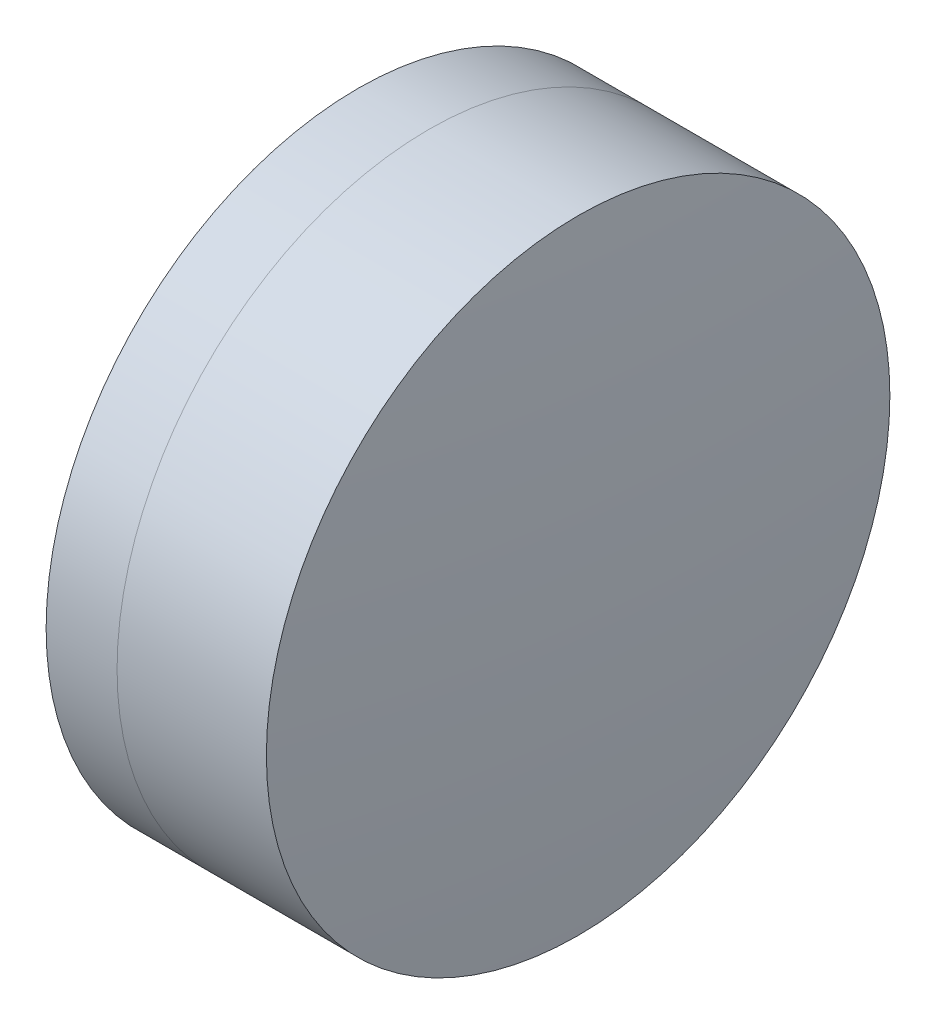
ISO-10303-21;
HEADER;
FILE_DESCRIPTION(('STEP AP214'),'2;1');
FILE_NAME('part.step','',(''),(''),'','','');
FILE_SCHEMA(('AUTOMOTIVE_DESIGN { 1 0 10303 214 1 1 1 1 }'));
ENDSEC;
DATA;
#1=APPLICATION_CONTEXT('core data for automotive mechanical design processes');
#2=APPLICATION_PROTOCOL_DEFINITION('international standard','automotive_design',2000,#1);
#3=PRODUCT_CONTEXT('',#1,'mechanical');
#4=PRODUCT('Part','Part','',(#3));
#5=PRODUCT_RELATED_PRODUCT_CATEGORY('part','',(#4));
#6=PRODUCT_DEFINITION_FORMATION('','',#4);
#7=PRODUCT_DEFINITION_CONTEXT('part definition',#1,'design');
#8=PRODUCT_DEFINITION('design','',#6,#7);
#9=PRODUCT_DEFINITION_SHAPE('','',#8);
#10=(LENGTH_UNIT() NAMED_UNIT(*) SI_UNIT(.MILLI.,.METRE.));
#11=(NAMED_UNIT(*) PLANE_ANGLE_UNIT() SI_UNIT($,.RADIAN.));
#12=(NAMED_UNIT(*) SI_UNIT($,.STERADIAN.) SOLID_ANGLE_UNIT());
#13=UNCERTAINTY_MEASURE_WITH_UNIT(LENGTH_MEASURE(1.E-05),#10,'distance_accuracy_value','');
#14=(GEOMETRIC_REPRESENTATION_CONTEXT(3) GLOBAL_UNCERTAINTY_ASSIGNED_CONTEXT((#13)) GLOBAL_UNIT_ASSIGNED_CONTEXT((#10,
#11,#12)) REPRESENTATION_CONTEXT('',''));
#15=CARTESIAN_POINT('',(0.,0.,0.));
#16=DIRECTION('',(0.,0.,1.));
#17=DIRECTION('',(1.,0.,0.));
#18=AXIS2_PLACEMENT_3D('',#15,#16,#17);
#19=CARTESIAN_POINT('',(257.503074490827,0.,0.));
#20=DIRECTION('',(-1.,0.,0.));
#21=DIRECTION('',(0.,0.,1.));
#22=AXIS2_PLACEMENT_3D('',#19,#20,#21);
#23=SPHERICAL_SURFACE('',#22,10.6);
#24=CARTESIAN_POINT('',(267.319387444274,0.,0.));
#25=DIRECTION('',(-1.,0.,0.));
#26=DIRECTION('',(0.,0.,1.));
#27=AXIS2_PLACEMENT_3D('',#24,#25,#26);
#28=CIRCLE('',#27,4.);
#29=CARTESIAN_POINT('',(267.319387444274,0.,4.));
#30=VERTEX_POINT('',#29);
#31=EDGE_CURVE('E11',#30,#30,#28,.T.);
#32=ORIENTED_EDGE('',*,*,#31,.T.);
#33=EDGE_LOOP('',(#32));
#34=FACE_BOUND('',#33,.T.);
#35=ADVANCED_FACE('F45',(#34),#23,.F.);
#36=CARTESIAN_POINT('',(-0.551919992657797,0.,0.));
#37=DIRECTION('',(-1.,0.,0.));
#38=DIRECTION('',(0.,0.,1.));
#39=AXIS2_PLACEMENT_3D('',#36,#37,#38);
#40=CYLINDRICAL_SURFACE('',#39,4.);
#41=CARTESIAN_POINT('',(269.235416444588,0.,0.));
#42=DIRECTION('',(-1.,0.,0.));
#43=DIRECTION('',(0.,0.,1.));
#44=AXIS2_PLACEMENT_3D('',#41,#42,#43);
#45=CIRCLE('',#44,4.);
#46=CARTESIAN_POINT('',(269.235416444588,0.,4.));
#47=VERTEX_POINT('',#46);
#48=EDGE_CURVE('E51',#47,#47,#45,.T.);
#49=ORIENTED_EDGE('',*,*,#48,.T.);
#50=EDGE_LOOP('',(#49));
#51=FACE_BOUND('',#50,.T.);
#52=ORIENTED_EDGE('',*,*,#31,.F.);
#53=EDGE_LOOP('',(#52));
#54=FACE_BOUND('',#53,.T.);
#55=ADVANCED_FACE('F57',(#51,#54),#40,.T.);
#56=CARTESIAN_POINT('',(221.603074490827,0.,0.));
#57=DIRECTION('',(-1.,0.,0.));
#58=DIRECTION('',(0.,0.,1.));
#59=AXIS2_PLACEMENT_3D('',#56,#57,#58);
#60=SPHERICAL_SURFACE('',#59,47.8);
#61=ORIENTED_EDGE('',*,*,#48,.F.);
#62=EDGE_LOOP('',(#61));
#63=FACE_BOUND('',#62,.T.);
#64=ADVANCED_FACE('F60',(#63),#60,.T.);
#65=CLOSED_SHELL('',(#35,#55,#64));
#66=MANIFOLD_SOLID_BREP('B2',#65);
#67=CARTESIAN_POINT('',(279.303074490827,0.,0.));
#68=DIRECTION('',(-1.,0.,0.));
#69=DIRECTION('',(0.,0.,1.));
#70=AXIS2_PLACEMENT_3D('',#67,#68,#69);
#71=SPHERICAL_SURFACE('',#70,13.5);
#72=CARTESIAN_POINT('',(266.4092775326,0.,0.));
#73=DIRECTION('',(-1.,0.,0.));
#74=DIRECTION('',(0.,0.,1.));
#75=AXIS2_PLACEMENT_3D('',#72,#73,#74);
#76=CIRCLE('',#75,4.);
#77=CARTESIAN_POINT('',(266.4092775326,0.,4.));
#78=VERTEX_POINT('',#77);
#79=EDGE_CURVE('E44',#78,#78,#76,.T.);
#80=ORIENTED_EDGE('',*,*,#79,.T.);
#81=EDGE_LOOP('',(#80));
#82=FACE_BOUND('',#81,.T.);
#83=ADVANCED_FACE('F86',(#82),#71,.T.);
#84=CARTESIAN_POINT('',(124.523309526045,0.,0.));
#85=DIRECTION('',(-1.,0.,0.));
#86=DIRECTION('',(0.,0.,1.));
#87=AXIS2_PLACEMENT_3D('',#84,#85,#86);
#88=CYLINDRICAL_SURFACE('',#87,4.);
#89=CARTESIAN_POINT('',(267.319387444274,0.,0.));
#90=DIRECTION('',(-1.,0.,0.));
#91=DIRECTION('',(0.,0.,1.));
#92=AXIS2_PLACEMENT_3D('',#89,#90,#91);
#93=CIRCLE('',#92,4.);
#94=CARTESIAN_POINT('',(267.319387444274,0.,4.));
#95=VERTEX_POINT('',#94);
#96=EDGE_CURVE('E92',#95,#95,#93,.T.);
#97=ORIENTED_EDGE('',*,*,#96,.T.);
#98=EDGE_LOOP('',(#97));
#99=FACE_BOUND('',#98,.T.);
#100=ORIENTED_EDGE('',*,*,#79,.F.);
#101=EDGE_LOOP('',(#100));
#102=FACE_BOUND('',#101,.T.);
#103=ADVANCED_FACE('F98',(#99,#102),#88,.T.);
#104=CARTESIAN_POINT('',(257.503074490827,0.,0.));
#105=DIRECTION('',(-1.,0.,0.));
#106=DIRECTION('',(0.,0.,1.));
#107=AXIS2_PLACEMENT_3D('',#104,#105,#106);
#108=SPHERICAL_SURFACE('',#107,10.6);
#109=ORIENTED_EDGE('',*,*,#96,.F.);
#110=EDGE_LOOP('',(#109));
#111=FACE_BOUND('',#110,.T.);
#112=ADVANCED_FACE('F101',(#111),#108,.T.);
#113=CLOSED_SHELL('',(#83,#103,#112));
#114=MANIFOLD_SOLID_BREP('B6',#113);
#115=ADVANCED_BREP_SHAPE_REPRESENTATION('',(#18,#66,#114),#14);
#116=SHAPE_DEFINITION_REPRESENTATION(#9,#115);
ENDSEC;
END-ISO-10303-21;
